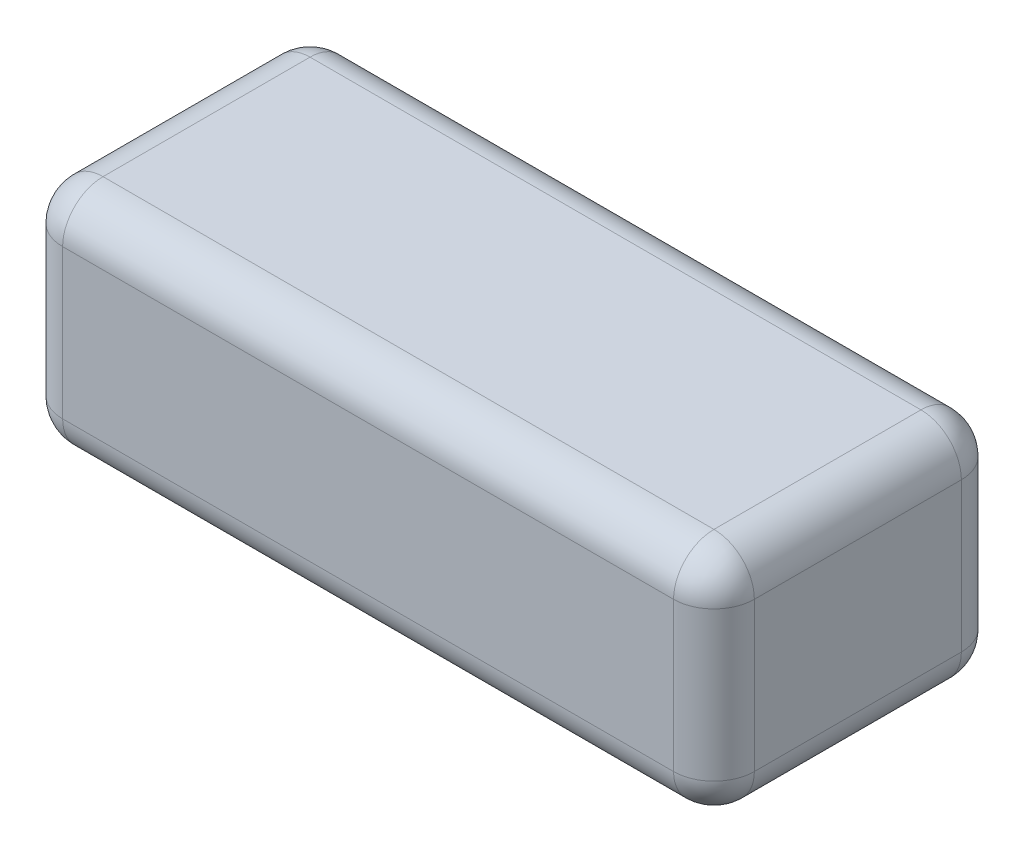
ISO-10303-21;
HEADER;
FILE_DESCRIPTION(('STEP AP214'),'2;1');
FILE_NAME('part.step','',(''),(''),'','','');
FILE_SCHEMA(('AUTOMOTIVE_DESIGN { 1 0 10303 214 1 1 1 1 }'));
ENDSEC;
DATA;
#1=APPLICATION_CONTEXT('core data for automotive mechanical design processes');
#2=APPLICATION_PROTOCOL_DEFINITION('international standard','automotive_design',2000,#1);
#3=PRODUCT_CONTEXT('',#1,'mechanical');
#4=PRODUCT('Part','Part','',(#3));
#5=PRODUCT_RELATED_PRODUCT_CATEGORY('part','',(#4));
#6=PRODUCT_DEFINITION_FORMATION('','',#4);
#7=PRODUCT_DEFINITION_CONTEXT('part definition',#1,'design');
#8=PRODUCT_DEFINITION('design','',#6,#7);
#9=PRODUCT_DEFINITION_SHAPE('','',#8);
#10=(LENGTH_UNIT() NAMED_UNIT(*) SI_UNIT(.MILLI.,.METRE.));
#11=(NAMED_UNIT(*) PLANE_ANGLE_UNIT() SI_UNIT($,.RADIAN.));
#12=(NAMED_UNIT(*) SI_UNIT($,.STERADIAN.) SOLID_ANGLE_UNIT());
#13=UNCERTAINTY_MEASURE_WITH_UNIT(LENGTH_MEASURE(1.E-05),#10,'distance_accuracy_value','');
#14=(GEOMETRIC_REPRESENTATION_CONTEXT(3) GLOBAL_UNCERTAINTY_ASSIGNED_CONTEXT((#13)) GLOBAL_UNIT_ASSIGNED_CONTEXT((#10,
#11,#12)) REPRESENTATION_CONTEXT('',''));
#15=CARTESIAN_POINT('',(0.,0.,0.));
#16=DIRECTION('',(0.,0.,1.));
#17=DIRECTION('',(1.,0.,0.));
#18=AXIS2_PLACEMENT_3D('',#15,#16,#17);
#19=CARTESIAN_POINT('',(-68.5,45.54,28.5));
#20=DIRECTION('',(1.,0.,0.));
#21=DIRECTION('',(0.,0.,-1.));
#22=AXIS2_PLACEMENT_3D('',#19,#20,#21);
#23=PLANE('',#22);
#24=DIRECTION('',(0.,-1.,0.));
#25=VECTOR('',#24,1.);
#26=CARTESIAN_POINT('',(-68.5,45.54,20.5));
#27=LINE('',#26,#25);
#28=CARTESIAN_POINT('',(-68.5,8.,20.5));
#29=VERTEX_POINT('',#28);
#30=CARTESIAN_POINT('',(-68.5,37.54,20.5));
#31=VERTEX_POINT('',#30);
#32=EDGE_CURVE('E138',#29,#31,#27,.F.);
#33=ORIENTED_EDGE('',*,*,#32,.T.);
#34=DIRECTION('',(0.,0.,1.));
#35=VECTOR('',#34,1.);
#36=CARTESIAN_POINT('',(-68.5,37.54,28.5));
#37=LINE('',#36,#35);
#38=CARTESIAN_POINT('',(-68.5,37.54,-20.5));
#39=VERTEX_POINT('',#38);
#40=EDGE_CURVE('E175',#31,#39,#37,.F.);
#41=ORIENTED_EDGE('',*,*,#40,.T.);
#42=DIRECTION('',(0.,-1.,0.));
#43=VECTOR('',#42,1.);
#44=CARTESIAN_POINT('',(-68.5,45.54,-20.5));
#45=LINE('',#44,#43);
#46=CARTESIAN_POINT('',(-68.5,8.,-20.5));
#47=VERTEX_POINT('',#46);
#48=EDGE_CURVE('E172',#39,#47,#45,.T.);
#49=ORIENTED_EDGE('',*,*,#48,.T.);
#50=DIRECTION('',(0.,0.,1.));
#51=VECTOR('',#50,1.);
#52=CARTESIAN_POINT('',(-68.5,8.,28.5));
#53=LINE('',#52,#51);
#54=EDGE_CURVE('E167',#47,#29,#53,.T.);
#55=ORIENTED_EDGE('',*,*,#54,.T.);
#56=EDGE_LOOP('',(#33,#41,#49,#55));
#57=FACE_BOUND('',#56,.T.);
#58=ADVANCED_FACE('F43',(#57),#23,.F.);
#59=CARTESIAN_POINT('',(-68.5,45.54,28.5));
#60=DIRECTION('',(0.,0.,-1.));
#61=DIRECTION('',(-1.,0.,0.));
#62=AXIS2_PLACEMENT_3D('',#59,#60,#61);
#63=PLANE('',#62);
#64=DIRECTION('',(0.,-1.,0.));
#65=VECTOR('',#64,1.);
#66=CARTESIAN_POINT('',(60.5,45.54,28.5));
#67=LINE('',#66,#65);
#68=CARTESIAN_POINT('',(60.5,8.,28.5));
#69=VERTEX_POINT('',#68);
#70=CARTESIAN_POINT('',(60.5,37.54,28.5));
#71=VERTEX_POINT('',#70);
#72=EDGE_CURVE('E160',#69,#71,#67,.F.);
#73=ORIENTED_EDGE('',*,*,#72,.T.);
#74=DIRECTION('',(1.,0.,0.));
#75=VECTOR('',#74,1.);
#76=CARTESIAN_POINT('',(-68.5,37.54,28.5));
#77=LINE('',#76,#75);
#78=CARTESIAN_POINT('',(-60.5,37.54,28.5));
#79=VERTEX_POINT('',#78);
#80=EDGE_CURVE('E164',#71,#79,#77,.F.);
#81=ORIENTED_EDGE('',*,*,#80,.T.);
#82=DIRECTION('',(0.,-1.,0.));
#83=VECTOR('',#82,1.);
#84=CARTESIAN_POINT('',(-60.5,45.54,28.5));
#85=LINE('',#84,#83);
#86=CARTESIAN_POINT('',(-60.5,8.,28.5));
#87=VERTEX_POINT('',#86);
#88=EDGE_CURVE('E136',#79,#87,#85,.T.);
#89=ORIENTED_EDGE('',*,*,#88,.T.);
#90=DIRECTION('',(1.,0.,0.));
#91=VECTOR('',#90,1.);
#92=CARTESIAN_POINT('',(68.5,8.,28.5));
#93=LINE('',#92,#91);
#94=EDGE_CURVE('E154',#87,#69,#93,.T.);
#95=ORIENTED_EDGE('',*,*,#94,.T.);
#96=EDGE_LOOP('',(#73,#81,#89,#95));
#97=FACE_BOUND('',#96,.T.);
#98=ADVANCED_FACE('F162',(#97),#63,.F.);
#99=CARTESIAN_POINT('',(68.5,45.54,28.5));
#100=DIRECTION('',(-1.,0.,0.));
#101=DIRECTION('',(0.,0.,1.));
#102=AXIS2_PLACEMENT_3D('',#99,#100,#101);
#103=PLANE('',#102);
#104=DIRECTION('',(0.,-1.,0.));
#105=VECTOR('',#104,1.);
#106=CARTESIAN_POINT('',(68.5,45.54,-20.5));
#107=LINE('',#106,#105);
#108=CARTESIAN_POINT('',(68.5,8.,-20.5));
#109=VERTEX_POINT('',#108);
#110=CARTESIAN_POINT('',(68.5,37.54,-20.5));
#111=VERTEX_POINT('',#110);
#112=EDGE_CURVE('E179',#109,#111,#107,.F.);
#113=ORIENTED_EDGE('',*,*,#112,.T.);
#114=DIRECTION('',(0.,0.,-1.));
#115=VECTOR('',#114,1.);
#116=CARTESIAN_POINT('',(68.5,37.54,28.5));
#117=LINE('',#116,#115);
#118=CARTESIAN_POINT('',(68.5,37.54,20.5));
#119=VERTEX_POINT('',#118);
#120=EDGE_CURVE('E184',#111,#119,#117,.F.);
#121=ORIENTED_EDGE('',*,*,#120,.T.);
#122=DIRECTION('',(0.,-1.,0.));
#123=VECTOR('',#122,1.);
#124=CARTESIAN_POINT('',(68.5,45.54,20.5));
#125=LINE('',#124,#123);
#126=CARTESIAN_POINT('',(68.5,8.,20.5));
#127=VERTEX_POINT('',#126);
#128=EDGE_CURVE('E181',#119,#127,#125,.T.);
#129=ORIENTED_EDGE('',*,*,#128,.T.);
#130=DIRECTION('',(0.,0.,-1.));
#131=VECTOR('',#130,1.);
#132=CARTESIAN_POINT('',(68.5,8.,-28.5));
#133=LINE('',#132,#131);
#134=EDGE_CURVE('E177',#127,#109,#133,.T.);
#135=ORIENTED_EDGE('',*,*,#134,.T.);
#136=EDGE_LOOP('',(#113,#121,#129,#135));
#137=FACE_BOUND('',#136,.T.);
#138=ADVANCED_FACE('F289',(#137),#103,.F.);
#139=CARTESIAN_POINT('',(-68.5,45.54,-28.5));
#140=DIRECTION('',(0.,0.,1.));
#141=DIRECTION('',(1.,0.,0.));
#142=AXIS2_PLACEMENT_3D('',#139,#140,#141);
#143=PLANE('',#142);
#144=DIRECTION('',(0.,-1.,0.));
#145=VECTOR('',#144,1.);
#146=CARTESIAN_POINT('',(-60.5,45.54,-28.5));
#147=LINE('',#146,#145);
#148=CARTESIAN_POINT('',(-60.5,8.,-28.5));
#149=VERTEX_POINT('',#148);
#150=CARTESIAN_POINT('',(-60.5,37.54,-28.5));
#151=VERTEX_POINT('',#150);
#152=EDGE_CURVE('E188',#149,#151,#147,.F.);
#153=ORIENTED_EDGE('',*,*,#152,.T.);
#154=DIRECTION('',(-1.,0.,0.));
#155=VECTOR('',#154,1.);
#156=CARTESIAN_POINT('',(-68.5,37.54,-28.5));
#157=LINE('',#156,#155);
#158=CARTESIAN_POINT('',(60.5,37.54,-28.5));
#159=VERTEX_POINT('',#158);
#160=EDGE_CURVE('E193',#151,#159,#157,.F.);
#161=ORIENTED_EDGE('',*,*,#160,.T.);
#162=DIRECTION('',(0.,-1.,0.));
#163=VECTOR('',#162,1.);
#164=CARTESIAN_POINT('',(60.5,45.54,-28.5));
#165=LINE('',#164,#163);
#166=CARTESIAN_POINT('',(60.5,8.,-28.5));
#167=VERTEX_POINT('',#166);
#168=EDGE_CURVE('E190',#159,#167,#165,.T.);
#169=ORIENTED_EDGE('',*,*,#168,.T.);
#170=DIRECTION('',(-1.,0.,0.));
#171=VECTOR('',#170,1.);
#172=CARTESIAN_POINT('',(-68.5,8.,-28.5));
#173=LINE('',#172,#171);
#174=EDGE_CURVE('E186',#167,#149,#173,.T.);
#175=ORIENTED_EDGE('',*,*,#174,.T.);
#176=EDGE_LOOP('',(#153,#161,#169,#175));
#177=FACE_BOUND('',#176,.T.);
#178=ADVANCED_FACE('F299',(#177),#143,.F.);
#179=CARTESIAN_POINT('',(0.,45.54,0.));
#180=DIRECTION('',(0.,-1.,0.));
#181=DIRECTION('',(0.,0.,-1.));
#182=AXIS2_PLACEMENT_3D('',#179,#180,#181);
#183=PLANE('',#182);
#184=DIRECTION('',(0.,0.,-1.));
#185=VECTOR('',#184,1.);
#186=CARTESIAN_POINT('',(60.5,45.54,0.));
#187=LINE('',#186,#185);
#188=CARTESIAN_POINT('',(60.5,45.54,20.5));
#189=VERTEX_POINT('',#188);
#190=CARTESIAN_POINT('',(60.5,45.54,-20.5));
#191=VERTEX_POINT('',#190);
#192=EDGE_CURVE('E199',#189,#191,#187,.T.);
#193=ORIENTED_EDGE('',*,*,#192,.T.);
#194=DIRECTION('',(-1.,0.,0.));
#195=VECTOR('',#194,1.);
#196=CARTESIAN_POINT('',(0.,45.54,-20.5));
#197=LINE('',#196,#195);
#198=CARTESIAN_POINT('',(-60.5,45.54,-20.5));
#199=VERTEX_POINT('',#198);
#200=EDGE_CURVE('E201',#191,#199,#197,.T.);
#201=ORIENTED_EDGE('',*,*,#200,.T.);
#202=DIRECTION('',(0.,0.,1.));
#203=VECTOR('',#202,1.);
#204=CARTESIAN_POINT('',(-60.5,45.54,0.));
#205=LINE('',#204,#203);
#206=CARTESIAN_POINT('',(-60.5,45.54,20.5));
#207=VERTEX_POINT('',#206);
#208=EDGE_CURVE('E195',#199,#207,#205,.T.);
#209=ORIENTED_EDGE('',*,*,#208,.T.);
#210=DIRECTION('',(1.,0.,0.));
#211=VECTOR('',#210,1.);
#212=CARTESIAN_POINT('',(0.,45.54,20.5));
#213=LINE('',#212,#211);
#214=EDGE_CURVE('E197',#207,#189,#213,.T.);
#215=ORIENTED_EDGE('',*,*,#214,.T.);
#216=EDGE_LOOP('',(#193,#201,#209,#215));
#217=FACE_BOUND('',#216,.T.);
#218=ADVANCED_FACE('F281',(#217),#183,.F.);
#219=CARTESIAN_POINT('',(0.,0.,0.));
#220=DIRECTION('',(0.,-1.,0.));
#221=DIRECTION('',(0.,0.,-1.));
#222=AXIS2_PLACEMENT_3D('',#219,#220,#221);
#223=PLANE('',#222);
#224=DIRECTION('',(0.,0.,1.));
#225=VECTOR('',#224,1.);
#226=CARTESIAN_POINT('',(-60.5,0.,-28.5));
#227=LINE('',#226,#225);
#228=CARTESIAN_POINT('',(-60.5,0.,20.5));
#229=VERTEX_POINT('',#228);
#230=CARTESIAN_POINT('',(-60.5,0.,-20.5));
#231=VERTEX_POINT('',#230);
#232=EDGE_CURVE('E204',#229,#231,#227,.F.);
#233=ORIENTED_EDGE('',*,*,#232,.T.);
#234=DIRECTION('',(-1.,0.,0.));
#235=VECTOR('',#234,1.);
#236=CARTESIAN_POINT('',(68.5,0.,-20.5));
#237=LINE('',#236,#235);
#238=CARTESIAN_POINT('',(60.5,0.,-20.5));
#239=VERTEX_POINT('',#238);
#240=EDGE_CURVE('E11',#231,#239,#237,.F.);
#241=ORIENTED_EDGE('',*,*,#240,.T.);
#242=DIRECTION('',(0.,0.,-1.));
#243=VECTOR('',#242,1.);
#244=CARTESIAN_POINT('',(60.5,0.,28.5));
#245=LINE('',#244,#243);
#246=CARTESIAN_POINT('',(60.5,0.,20.5));
#247=VERTEX_POINT('',#246);
#248=EDGE_CURVE('E52',#239,#247,#245,.F.);
#249=ORIENTED_EDGE('',*,*,#248,.T.);
#250=DIRECTION('',(1.,0.,0.));
#251=VECTOR('',#250,1.);
#252=CARTESIAN_POINT('',(-68.5,0.,20.5));
#253=LINE('',#252,#251);
#254=EDGE_CURVE('E206',#247,#229,#253,.F.);
#255=ORIENTED_EDGE('',*,*,#254,.T.);
#256=EDGE_LOOP('',(#233,#241,#249,#255));
#257=FACE_BOUND('',#256,.T.);
#258=ADVANCED_FACE('F527',(#257),#223,.T.);
#259=CARTESIAN_POINT('',(60.5,45.54,-20.5));
#260=DIRECTION('',(0.,-1.,0.));
#261=DIRECTION('',(0.,0.,-1.));
#262=AXIS2_PLACEMENT_3D('',#259,#260,#261);
#263=CYLINDRICAL_SURFACE('',#262,8.);
#264=CARTESIAN_POINT('',(60.5,37.54,-20.5));
#265=DIRECTION('',(0.,1.,0.));
#266=DIRECTION('',(0.,0.,1.));
#267=AXIS2_PLACEMENT_3D('',#264,#265,#266);
#268=CIRCLE('',#267,8.);
#269=EDGE_CURVE('E47',#111,#159,#268,.T.);
#270=ORIENTED_EDGE('',*,*,#269,.F.);
#271=ORIENTED_EDGE('',*,*,#112,.F.);
#272=CARTESIAN_POINT('',(60.5,8.,-20.5));
#273=DIRECTION('',(0.,-1.,0.));
#274=DIRECTION('',(0.,0.,-1.));
#275=AXIS2_PLACEMENT_3D('',#272,#273,#274);
#276=CIRCLE('',#275,8.);
#277=EDGE_CURVE('E259',#167,#109,#276,.T.);
#278=ORIENTED_EDGE('',*,*,#277,.F.);
#279=ORIENTED_EDGE('',*,*,#168,.F.);
#280=EDGE_LOOP('',(#270,#271,#278,#279));
#281=FACE_BOUND('',#280,.T.);
#282=ADVANCED_FACE('F45',(#281),#263,.T.);
#283=CARTESIAN_POINT('',(60.5,37.54,-20.5));
#284=DIRECTION('',(0.,0.,-1.));
#285=DIRECTION('',(-1.,0.,0.));
#286=AXIS2_PLACEMENT_3D('',#283,#284,#285);
#287=SPHERICAL_SURFACE('',#286,8.);
#288=CARTESIAN_POINT('',(60.5,37.54,-20.5));
#289=DIRECTION('',(0.,0.,-1.));
#290=DIRECTION('',(-1.,0.,0.));
#291=AXIS2_PLACEMENT_3D('',#288,#289,#290);
#292=CIRCLE('',#291,8.);
#293=EDGE_CURVE('E254',#111,#191,#292,.F.);
#294=ORIENTED_EDGE('',*,*,#293,.F.);
#295=ORIENTED_EDGE('',*,*,#269,.T.);
#296=CARTESIAN_POINT('',(60.5,37.54,-20.5));
#297=DIRECTION('',(1.,0.,0.));
#298=DIRECTION('',(0.,1.,0.));
#299=AXIS2_PLACEMENT_3D('',#296,#297,#298);
#300=CIRCLE('',#299,8.);
#301=EDGE_CURVE('E257',#191,#159,#300,.F.);
#302=ORIENTED_EDGE('',*,*,#301,.F.);
#303=EDGE_LOOP('',(#294,#295,#302));
#304=FACE_BOUND('',#303,.T.);
#305=ADVANCED_FACE('F269',(#304),#287,.T.);
#306=CARTESIAN_POINT('',(60.5,8.,-20.5));
#307=DIRECTION('',(1.,0.,0.));
#308=DIRECTION('',(0.,0.,-1.));
#309=AXIS2_PLACEMENT_3D('',#306,#307,#308);
#310=SPHERICAL_SURFACE('',#309,8.);
#311=CARTESIAN_POINT('',(60.5,8.,-20.5));
#312=DIRECTION('',(1.,0.,0.));
#313=DIRECTION('',(0.,0.,-1.));
#314=AXIS2_PLACEMENT_3D('',#311,#312,#313);
#315=CIRCLE('',#314,8.);
#316=EDGE_CURVE('E249',#167,#239,#315,.F.);
#317=ORIENTED_EDGE('',*,*,#316,.F.);
#318=ORIENTED_EDGE('',*,*,#277,.T.);
#319=CARTESIAN_POINT('',(60.5,8.,-20.5));
#320=DIRECTION('',(0.,0.,-1.));
#321=DIRECTION('',(-1.,0.,0.));
#322=AXIS2_PLACEMENT_3D('',#319,#320,#321);
#323=CIRCLE('',#322,8.);
#324=EDGE_CURVE('E252',#239,#109,#323,.F.);
#325=ORIENTED_EDGE('',*,*,#324,.F.);
#326=EDGE_LOOP('',(#317,#318,#325));
#327=FACE_BOUND('',#326,.T.);
#328=ADVANCED_FACE('F500',(#327),#310,.T.);
#329=CARTESIAN_POINT('',(0.,37.54,-20.5));
#330=DIRECTION('',(-1.,0.,0.));
#331=DIRECTION('',(0.,0.,1.));
#332=AXIS2_PLACEMENT_3D('',#329,#330,#331);
#333=CYLINDRICAL_SURFACE('',#332,8.);
#334=ORIENTED_EDGE('',*,*,#301,.T.);
#335=ORIENTED_EDGE('',*,*,#160,.F.);
#336=CARTESIAN_POINT('',(-60.5,37.54,-20.5));
#337=DIRECTION('',(-1.,0.,0.));
#338=DIRECTION('',(0.,0.,1.));
#339=AXIS2_PLACEMENT_3D('',#336,#337,#338);
#340=CIRCLE('',#339,8.);
#341=EDGE_CURVE('E243',#199,#151,#340,.T.);
#342=ORIENTED_EDGE('',*,*,#341,.F.);
#343=ORIENTED_EDGE('',*,*,#200,.F.);
#344=EDGE_LOOP('',(#334,#335,#342,#343));
#345=FACE_BOUND('',#344,.T.);
#346=ADVANCED_FACE('F277',(#345),#333,.T.);
#347=CARTESIAN_POINT('',(60.5,37.54,0.));
#348=DIRECTION('',(0.,0.,-1.));
#349=DIRECTION('',(-1.,0.,0.));
#350=AXIS2_PLACEMENT_3D('',#347,#348,#349);
#351=CYLINDRICAL_SURFACE('',#350,8.);
#352=ORIENTED_EDGE('',*,*,#293,.T.);
#353=ORIENTED_EDGE('',*,*,#192,.F.);
#354=CARTESIAN_POINT('',(60.5,37.54,20.5));
#355=DIRECTION('',(0.,0.,1.));
#356=DIRECTION('',(0.,-1.,0.));
#357=AXIS2_PLACEMENT_3D('',#354,#355,#356);
#358=CIRCLE('',#357,8.);
#359=EDGE_CURVE('E240',#119,#189,#358,.T.);
#360=ORIENTED_EDGE('',*,*,#359,.F.);
#361=ORIENTED_EDGE('',*,*,#120,.F.);
#362=EDGE_LOOP('',(#352,#353,#360,#361));
#363=FACE_BOUND('',#362,.T.);
#364=ADVANCED_FACE('F286',(#363),#351,.T.);
#365=CARTESIAN_POINT('',(60.5,45.54,20.5));
#366=DIRECTION('',(0.,-1.,0.));
#367=DIRECTION('',(0.,0.,-1.));
#368=AXIS2_PLACEMENT_3D('',#365,#366,#367);
#369=CYLINDRICAL_SURFACE('',#368,8.);
#370=CARTESIAN_POINT('',(60.5,8.,20.5));
#371=DIRECTION('',(0.,-1.,0.));
#372=DIRECTION('',(0.,0.,-1.));
#373=AXIS2_PLACEMENT_3D('',#370,#371,#372);
#374=CIRCLE('',#373,8.);
#375=EDGE_CURVE('E234',#127,#69,#374,.T.);
#376=ORIENTED_EDGE('',*,*,#375,.F.);
#377=ORIENTED_EDGE('',*,*,#128,.F.);
#378=CARTESIAN_POINT('',(60.5,37.54,20.5));
#379=DIRECTION('',(0.,1.,0.));
#380=DIRECTION('',(0.,0.,1.));
#381=AXIS2_PLACEMENT_3D('',#378,#379,#380);
#382=CIRCLE('',#381,8.);
#383=EDGE_CURVE('E237',#71,#119,#382,.T.);
#384=ORIENTED_EDGE('',*,*,#383,.F.);
#385=ORIENTED_EDGE('',*,*,#72,.F.);
#386=EDGE_LOOP('',(#376,#377,#384,#385));
#387=FACE_BOUND('',#386,.T.);
#388=ADVANCED_FACE('F293',(#387),#369,.T.);
#389=CARTESIAN_POINT('',(60.5,8.,28.5));
#390=DIRECTION('',(0.,0.,1.));
#391=DIRECTION('',(1.,0.,0.));
#392=AXIS2_PLACEMENT_3D('',#389,#390,#391);
#393=CYLINDRICAL_SURFACE('',#392,8.);
#394=ORIENTED_EDGE('',*,*,#324,.T.);
#395=ORIENTED_EDGE('',*,*,#134,.F.);
#396=CARTESIAN_POINT('',(60.5,8.,20.5));
#397=DIRECTION('',(0.,0.,1.));
#398=DIRECTION('',(1.,0.,0.));
#399=AXIS2_PLACEMENT_3D('',#396,#397,#398);
#400=CIRCLE('',#399,8.);
#401=EDGE_CURVE('E232',#247,#127,#400,.T.);
#402=ORIENTED_EDGE('',*,*,#401,.F.);
#403=ORIENTED_EDGE('',*,*,#248,.F.);
#404=EDGE_LOOP('',(#394,#395,#402,#403));
#405=FACE_BOUND('',#404,.T.);
#406=ADVANCED_FACE('F297',(#405),#393,.T.);
#407=CARTESIAN_POINT('',(-68.5,8.,-20.5));
#408=DIRECTION('',(1.,0.,0.));
#409=DIRECTION('',(0.,0.,-1.));
#410=AXIS2_PLACEMENT_3D('',#407,#408,#409);
#411=CYLINDRICAL_SURFACE('',#410,8.);
#412=ORIENTED_EDGE('',*,*,#316,.T.);
#413=ORIENTED_EDGE('',*,*,#240,.F.);
#414=CARTESIAN_POINT('',(-60.5,8.,-20.5));
#415=DIRECTION('',(-1.,0.,0.));
#416=DIRECTION('',(0.,0.,1.));
#417=AXIS2_PLACEMENT_3D('',#414,#415,#416);
#418=CIRCLE('',#417,8.);
#419=EDGE_CURVE('E229',#149,#231,#418,.T.);
#420=ORIENTED_EDGE('',*,*,#419,.F.);
#421=ORIENTED_EDGE('',*,*,#174,.F.);
#422=EDGE_LOOP('',(#412,#413,#420,#421));
#423=FACE_BOUND('',#422,.T.);
#424=ADVANCED_FACE('F309',(#423),#411,.T.);
#425=CARTESIAN_POINT('',(-60.5,45.54,-20.5));
#426=DIRECTION('',(0.,-1.,0.));
#427=DIRECTION('',(0.,0.,-1.));
#428=AXIS2_PLACEMENT_3D('',#425,#426,#427);
#429=CYLINDRICAL_SURFACE('',#428,8.);
#430=CARTESIAN_POINT('',(-60.5,37.54,-20.5));
#431=DIRECTION('',(0.,1.,0.));
#432=DIRECTION('',(0.,0.,1.));
#433=AXIS2_PLACEMENT_3D('',#430,#431,#432);
#434=CIRCLE('',#433,8.);
#435=EDGE_CURVE('E246',#151,#39,#434,.T.);
#436=ORIENTED_EDGE('',*,*,#435,.F.);
#437=ORIENTED_EDGE('',*,*,#152,.F.);
#438=CARTESIAN_POINT('',(-60.5,8.,-20.5));
#439=DIRECTION('',(0.,-1.,0.));
#440=DIRECTION('',(0.,0.,-1.));
#441=AXIS2_PLACEMENT_3D('',#438,#439,#440);
#442=CIRCLE('',#441,8.);
#443=EDGE_CURVE('E226',#47,#149,#442,.T.);
#444=ORIENTED_EDGE('',*,*,#443,.F.);
#445=ORIENTED_EDGE('',*,*,#48,.F.);
#446=EDGE_LOOP('',(#436,#437,#444,#445));
#447=FACE_BOUND('',#446,.T.);
#448=ADVANCED_FACE('F304',(#447),#429,.T.);
#449=CARTESIAN_POINT('',(-60.5,37.54,-20.5));
#450=DIRECTION('',(0.,0.,-1.));
#451=DIRECTION('',(-1.,0.,0.));
#452=AXIS2_PLACEMENT_3D('',#449,#450,#451);
#453=SPHERICAL_SURFACE('',#452,8.);
#454=ORIENTED_EDGE('',*,*,#341,.T.);
#455=ORIENTED_EDGE('',*,*,#435,.T.);
#456=CARTESIAN_POINT('',(-60.5,37.54,-20.5));
#457=DIRECTION('',(0.,0.,-1.));
#458=DIRECTION('',(-1.,0.,0.));
#459=AXIS2_PLACEMENT_3D('',#456,#457,#458);
#460=CIRCLE('',#459,8.);
#461=EDGE_CURVE('E223',#199,#39,#460,.F.);
#462=ORIENTED_EDGE('',*,*,#461,.F.);
#463=EDGE_LOOP('',(#454,#455,#462));
#464=FACE_BOUND('',#463,.T.);
#465=ADVANCED_FACE('F320',(#464),#453,.T.);
#466=CARTESIAN_POINT('',(60.5,37.54,20.5));
#467=DIRECTION('',(1.,0.,0.));
#468=DIRECTION('',(0.,0.,-1.));
#469=AXIS2_PLACEMENT_3D('',#466,#467,#468);
#470=SPHERICAL_SURFACE('',#469,8.);
#471=ORIENTED_EDGE('',*,*,#383,.T.);
#472=ORIENTED_EDGE('',*,*,#359,.T.);
#473=CARTESIAN_POINT('',(60.5,37.54,20.5));
#474=DIRECTION('',(1.,0.,0.));
#475=DIRECTION('',(0.,0.,-1.));
#476=AXIS2_PLACEMENT_3D('',#473,#474,#475);
#477=CIRCLE('',#476,8.);
#478=EDGE_CURVE('E220',#71,#189,#477,.F.);
#479=ORIENTED_EDGE('',*,*,#478,.F.);
#480=EDGE_LOOP('',(#471,#472,#479));
#481=FACE_BOUND('',#480,.T.);
#482=ADVANCED_FACE('F330',(#481),#470,.T.);
#483=CARTESIAN_POINT('',(60.5,8.,20.5));
#484=DIRECTION('',(1.,0.,0.));
#485=DIRECTION('',(0.,0.,-1.));
#486=AXIS2_PLACEMENT_3D('',#483,#484,#485);
#487=SPHERICAL_SURFACE('',#486,8.);
#488=ORIENTED_EDGE('',*,*,#401,.T.);
#489=ORIENTED_EDGE('',*,*,#375,.T.);
#490=CARTESIAN_POINT('',(60.5,8.,20.5));
#491=DIRECTION('',(1.,0.,0.));
#492=DIRECTION('',(0.,0.,-1.));
#493=AXIS2_PLACEMENT_3D('',#490,#491,#492);
#494=CIRCLE('',#493,8.);
#495=EDGE_CURVE('E157',#247,#69,#494,.F.);
#496=ORIENTED_EDGE('',*,*,#495,.F.);
#497=EDGE_LOOP('',(#488,#489,#496));
#498=FACE_BOUND('',#497,.T.);
#499=ADVANCED_FACE('F332',(#498),#487,.T.);
#500=CARTESIAN_POINT('',(-60.5,8.,-20.5));
#501=DIRECTION('',(0.,0.,-1.));
#502=DIRECTION('',(-1.,0.,0.));
#503=AXIS2_PLACEMENT_3D('',#500,#501,#502);
#504=SPHERICAL_SURFACE('',#503,8.);
#505=ORIENTED_EDGE('',*,*,#443,.T.);
#506=ORIENTED_EDGE('',*,*,#419,.T.);
#507=CARTESIAN_POINT('',(-60.5,8.,-20.5));
#508=DIRECTION('',(0.,0.,-1.));
#509=DIRECTION('',(-1.,0.,0.));
#510=AXIS2_PLACEMENT_3D('',#507,#508,#509);
#511=CIRCLE('',#510,8.);
#512=EDGE_CURVE('E216',#47,#231,#511,.F.);
#513=ORIENTED_EDGE('',*,*,#512,.F.);
#514=EDGE_LOOP('',(#505,#506,#513));
#515=FACE_BOUND('',#514,.T.);
#516=ADVANCED_FACE('F311',(#515),#504,.T.);
#517=CARTESIAN_POINT('',(-60.5,37.54,0.));
#518=DIRECTION('',(0.,0.,1.));
#519=DIRECTION('',(1.,0.,0.));
#520=AXIS2_PLACEMENT_3D('',#517,#518,#519);
#521=CYLINDRICAL_SURFACE('',#520,8.);
#522=ORIENTED_EDGE('',*,*,#461,.T.);
#523=ORIENTED_EDGE('',*,*,#40,.F.);
#524=CARTESIAN_POINT('',(-60.5,37.54,20.5));
#525=DIRECTION('',(0.,0.,1.));
#526=DIRECTION('',(1.,0.,0.));
#527=AXIS2_PLACEMENT_3D('',#524,#525,#526);
#528=CIRCLE('',#527,8.);
#529=EDGE_CURVE('E213',#207,#31,#528,.T.);
#530=ORIENTED_EDGE('',*,*,#529,.F.);
#531=ORIENTED_EDGE('',*,*,#208,.F.);
#532=EDGE_LOOP('',(#522,#523,#530,#531));
#533=FACE_BOUND('',#532,.T.);
#534=ADVANCED_FACE('F322',(#533),#521,.T.);
#535=CARTESIAN_POINT('',(0.,37.54,20.5));
#536=DIRECTION('',(1.,0.,0.));
#537=DIRECTION('',(0.,0.,-1.));
#538=AXIS2_PLACEMENT_3D('',#535,#536,#537);
#539=CYLINDRICAL_SURFACE('',#538,8.);
#540=ORIENTED_EDGE('',*,*,#478,.T.);
#541=ORIENTED_EDGE('',*,*,#214,.F.);
#542=CARTESIAN_POINT('',(-60.5,37.54,20.5));
#543=DIRECTION('',(-1.,0.,0.));
#544=DIRECTION('',(0.,0.,1.));
#545=AXIS2_PLACEMENT_3D('',#542,#543,#544);
#546=CIRCLE('',#545,8.);
#547=EDGE_CURVE('E151',#79,#207,#546,.T.);
#548=ORIENTED_EDGE('',*,*,#547,.F.);
#549=ORIENTED_EDGE('',*,*,#80,.F.);
#550=EDGE_LOOP('',(#540,#541,#548,#549));
#551=FACE_BOUND('',#550,.T.);
#552=ADVANCED_FACE('F328',(#551),#539,.T.);
#553=CARTESIAN_POINT('',(-68.5,8.,20.5));
#554=DIRECTION('',(-1.,0.,0.));
#555=DIRECTION('',(0.,0.,1.));
#556=AXIS2_PLACEMENT_3D('',#553,#554,#555);
#557=CYLINDRICAL_SURFACE('',#556,8.);
#558=ORIENTED_EDGE('',*,*,#495,.T.);
#559=ORIENTED_EDGE('',*,*,#94,.F.);
#560=CARTESIAN_POINT('',(-60.5,8.,20.5));
#561=DIRECTION('',(-1.,0.,0.));
#562=DIRECTION('',(0.,0.,1.));
#563=AXIS2_PLACEMENT_3D('',#560,#561,#562);
#564=CIRCLE('',#563,8.);
#565=EDGE_CURVE('E144',#229,#87,#564,.T.);
#566=ORIENTED_EDGE('',*,*,#565,.F.);
#567=ORIENTED_EDGE('',*,*,#254,.F.);
#568=EDGE_LOOP('',(#558,#559,#566,#567));
#569=FACE_BOUND('',#568,.T.);
#570=ADVANCED_FACE('F155',(#569),#557,.T.);
#571=CARTESIAN_POINT('',(-60.5,8.,28.5));
#572=DIRECTION('',(0.,0.,-1.));
#573=DIRECTION('',(-1.,0.,0.));
#574=AXIS2_PLACEMENT_3D('',#571,#572,#573);
#575=CYLINDRICAL_SURFACE('',#574,8.);
#576=ORIENTED_EDGE('',*,*,#512,.T.);
#577=ORIENTED_EDGE('',*,*,#232,.F.);
#578=CARTESIAN_POINT('',(-60.5,8.,20.5));
#579=DIRECTION('',(0.,0.,1.));
#580=DIRECTION('',(1.,0.,0.));
#581=AXIS2_PLACEMENT_3D('',#578,#579,#580);
#582=CIRCLE('',#581,8.);
#583=EDGE_CURVE('E148',#29,#229,#582,.T.);
#584=ORIENTED_EDGE('',*,*,#583,.F.);
#585=ORIENTED_EDGE('',*,*,#54,.F.);
#586=EDGE_LOOP('',(#576,#577,#584,#585));
#587=FACE_BOUND('',#586,.T.);
#588=ADVANCED_FACE('F315',(#587),#575,.T.);
#589=CARTESIAN_POINT('',(-60.5,37.54,20.5));
#590=DIRECTION('',(0.,1.,0.));
#591=DIRECTION('',(0.,0.,1.));
#592=AXIS2_PLACEMENT_3D('',#589,#590,#591);
#593=SPHERICAL_SURFACE('',#592,8.);
#594=ORIENTED_EDGE('',*,*,#547,.T.);
#595=ORIENTED_EDGE('',*,*,#529,.T.);
#596=CARTESIAN_POINT('',(-60.5,37.54,20.5));
#597=DIRECTION('',(0.,1.,0.));
#598=DIRECTION('',(0.,0.,1.));
#599=AXIS2_PLACEMENT_3D('',#596,#597,#598);
#600=CIRCLE('',#599,8.);
#601=EDGE_CURVE('E141',#79,#31,#600,.F.);
#602=ORIENTED_EDGE('',*,*,#601,.F.);
#603=EDGE_LOOP('',(#594,#595,#602));
#604=FACE_BOUND('',#603,.T.);
#605=ADVANCED_FACE('F326',(#604),#593,.T.);
#606=CARTESIAN_POINT('',(-60.5,8.,20.5));
#607=DIRECTION('',(0.,-1.,0.));
#608=DIRECTION('',(0.,0.,-1.));
#609=AXIS2_PLACEMENT_3D('',#606,#607,#608);
#610=SPHERICAL_SURFACE('',#609,8.);
#611=ORIENTED_EDGE('',*,*,#583,.T.);
#612=ORIENTED_EDGE('',*,*,#565,.T.);
#613=CARTESIAN_POINT('',(-60.5,8.,20.5));
#614=DIRECTION('',(0.,-1.,0.));
#615=DIRECTION('',(0.,0.,-1.));
#616=AXIS2_PLACEMENT_3D('',#613,#614,#615);
#617=CIRCLE('',#616,8.);
#618=EDGE_CURVE('E132',#29,#87,#617,.F.);
#619=ORIENTED_EDGE('',*,*,#618,.F.);
#620=EDGE_LOOP('',(#611,#612,#619));
#621=FACE_BOUND('',#620,.T.);
#622=ADVANCED_FACE('F146',(#621),#610,.T.);
#623=CARTESIAN_POINT('',(-60.5,45.54,20.5));
#624=DIRECTION('',(0.,-1.,0.));
#625=DIRECTION('',(0.,0.,-1.));
#626=AXIS2_PLACEMENT_3D('',#623,#624,#625);
#627=CYLINDRICAL_SURFACE('',#626,8.);
#628=ORIENTED_EDGE('',*,*,#601,.T.);
#629=ORIENTED_EDGE('',*,*,#32,.F.);
#630=ORIENTED_EDGE('',*,*,#618,.T.);
#631=ORIENTED_EDGE('',*,*,#88,.F.);
#632=EDGE_LOOP('',(#628,#629,#630,#631));
#633=FACE_BOUND('',#632,.T.);
#634=ADVANCED_FACE('F134',(#633),#627,.T.);
#635=CLOSED_SHELL('',(#58,#98,#138,#178,#218,#258,#282,#305,#328,#346,#364,#388,#406,#424,#448,
#465,#482,#499,#516,#534,#552,#570,#588,#605,#622,#634));
#636=MANIFOLD_SOLID_BREP('B2',#635);
#637=ADVANCED_BREP_SHAPE_REPRESENTATION('',(#18,#636),#14);
#638=SHAPE_DEFINITION_REPRESENTATION(#9,#637);
ENDSEC;
END-ISO-10303-21;
